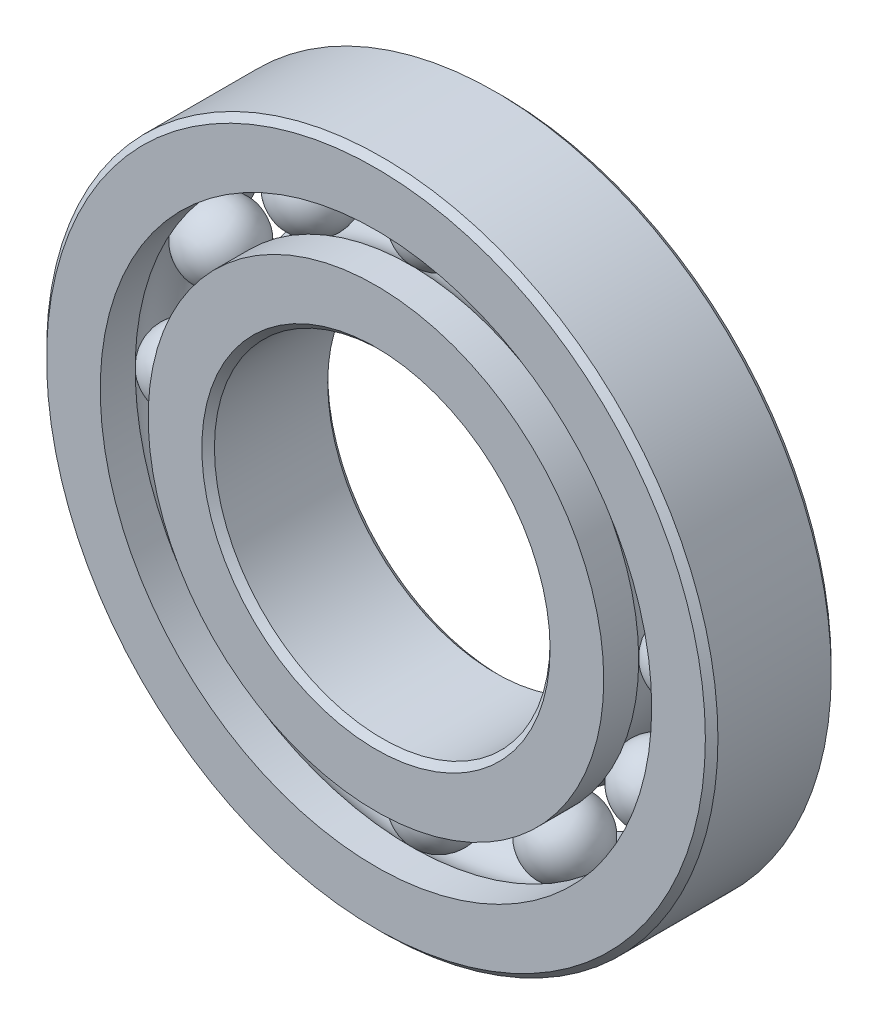
ISO-10303-21;
HEADER;
FILE_DESCRIPTION(('STEP AP214'),'2;1');
FILE_NAME('part.step','',(''),(''),'','','');
FILE_SCHEMA(('AUTOMOTIVE_DESIGN { 1 0 10303 214 1 1 1 1 }'));
ENDSEC;
DATA;
#1=APPLICATION_CONTEXT('core data for automotive mechanical design processes');
#2=APPLICATION_PROTOCOL_DEFINITION('international standard','automotive_design',2000,#1);
#3=PRODUCT_CONTEXT('',#1,'mechanical');
#4=PRODUCT('Part','Part','',(#3));
#5=PRODUCT_RELATED_PRODUCT_CATEGORY('part','',(#4));
#6=PRODUCT_DEFINITION_FORMATION('','',#4);
#7=PRODUCT_DEFINITION_CONTEXT('part definition',#1,'design');
#8=PRODUCT_DEFINITION('design','',#6,#7);
#9=PRODUCT_DEFINITION_SHAPE('','',#8);
#10=(LENGTH_UNIT() NAMED_UNIT(*) SI_UNIT(.MILLI.,.METRE.));
#11=(NAMED_UNIT(*) PLANE_ANGLE_UNIT() SI_UNIT($,.RADIAN.));
#12=(NAMED_UNIT(*) SI_UNIT($,.STERADIAN.) SOLID_ANGLE_UNIT());
#13=UNCERTAINTY_MEASURE_WITH_UNIT(LENGTH_MEASURE(1.E-05),#10,'distance_accuracy_value','');
#14=(GEOMETRIC_REPRESENTATION_CONTEXT(3) GLOBAL_UNCERTAINTY_ASSIGNED_CONTEXT((#13)) GLOBAL_UNIT_ASSIGNED_CONTEXT((#10,
#11,#12)) REPRESENTATION_CONTEXT('',''));
#15=CARTESIAN_POINT('',(0.,0.,0.));
#16=DIRECTION('',(0.,0.,1.));
#17=DIRECTION('',(1.,0.,0.));
#18=AXIS2_PLACEMENT_3D('',#15,#16,#17);
#19=CARTESIAN_POINT('',(-9.52499999999979,16.4977839420937,0.));
#20=DIRECTION('',(0.,0.,1.));
#21=DIRECTION('',(-0.499999999999989,0.866025403784445,0.));
#22=AXIS2_PLACEMENT_3D('',#19,#20,#21);
#23=SPHERICAL_SURFACE('',#22,2.78781463351475);
#24=CARTESIAN_POINT('',(-9.52499999999979,16.4977839420937,2.78781463351475));
#25=VERTEX_POINT('',#24);
#26=VERTEX_LOOP('',#25);
#27=FACE_BOUND('',#26,.T.);
#28=ADVANCED_FACE('F39',(#27),#23,.T.);
#29=CLOSED_SHELL('',(#28));
#30=MANIFOLD_SOLID_BREP('B2',#29);
#31=CARTESIAN_POINT('',(-16.4977839420934,9.52500000000019,0.));
#32=DIRECTION('',(0.,0.,1.));
#33=DIRECTION('',(-0.866025403784433,0.50000000000001,0.));
#34=AXIS2_PLACEMENT_3D('',#31,#32,#33);
#35=SPHERICAL_SURFACE('',#34,2.78781463351475);
#36=CARTESIAN_POINT('',(-16.4977839420934,9.52500000000019,2.78781463351475));
#37=VERTEX_POINT('',#36);
#38=VERTEX_LOOP('',#37);
#39=FACE_BOUND('',#38,.T.);
#40=ADVANCED_FACE('F59',(#39),#35,.T.);
#41=CLOSED_SHELL('',(#40));
#42=MANIFOLD_SOLID_BREP('B6',#41);
#43=CARTESIAN_POINT('',(-19.05,1.99538274087401E-13,0.));
#44=DIRECTION('',(0.,0.,1.));
#45=DIRECTION('',(-1.,0.,0.));
#46=AXIS2_PLACEMENT_3D('',#43,#44,#45);
#47=SPHERICAL_SURFACE('',#46,2.78781463351475);
#48=CARTESIAN_POINT('',(-19.05,1.99538274087401E-13,2.78781463351475));
#49=VERTEX_POINT('',#48);
#50=VERTEX_LOOP('',#49);
#51=FACE_BOUND('',#50,.T.);
#52=ADVANCED_FACE('F79',(#51),#47,.T.);
#53=CLOSED_SHELL('',(#52));
#54=MANIFOLD_SOLID_BREP('B35',#53);
#55=CARTESIAN_POINT('',(-16.4977839420936,-9.52499999999985,0.));
#56=DIRECTION('',(0.,0.,1.));
#57=DIRECTION('',(-0.866025403784443,-0.499999999999992,0.));
#58=AXIS2_PLACEMENT_3D('',#55,#56,#57);
#59=SPHERICAL_SURFACE('',#58,2.78781463351475);
#60=CARTESIAN_POINT('',(-16.4977839420936,-9.52499999999985,2.78781463351475));
#61=VERTEX_POINT('',#60);
#62=VERTEX_LOOP('',#61);
#63=FACE_BOUND('',#62,.T.);
#64=ADVANCED_FACE('F99',(#63),#59,.T.);
#65=CLOSED_SHELL('',(#64));
#66=MANIFOLD_SOLID_BREP('B55',#65);
#67=CARTESIAN_POINT('',(-9.52500000000014,-16.4977839420935,0.));
#68=DIRECTION('',(0.,0.,1.));
#69=DIRECTION('',(-0.500000000000007,-0.866025403784435,0.));
#70=AXIS2_PLACEMENT_3D('',#67,#68,#69);
#71=SPHERICAL_SURFACE('',#70,2.78781463351475);
#72=CARTESIAN_POINT('',(-9.52500000000014,-16.4977839420935,2.78781463351475));
#73=VERTEX_POINT('',#72);
#74=VERTEX_LOOP('',#73);
#75=FACE_BOUND('',#74,.T.);
#76=ADVANCED_FACE('F119',(#75),#71,.T.);
#77=CLOSED_SHELL('',(#76));
#78=MANIFOLD_SOLID_BREP('B75',#77);
#79=CARTESIAN_POINT('',(-1.33025516058267E-13,-19.05,0.));
#80=DIRECTION('',(0.,0.,1.));
#81=DIRECTION('',(0.,-1.,0.));
#82=AXIS2_PLACEMENT_3D('',#79,#80,#81);
#83=SPHERICAL_SURFACE('',#82,2.78781463351475);
#84=CARTESIAN_POINT('',(-1.33025516058267E-13,-19.05,2.78781463351475));
#85=VERTEX_POINT('',#84);
#86=VERTEX_LOOP('',#85);
#87=FACE_BOUND('',#86,.T.);
#88=ADVANCED_FACE('F139',(#87),#83,.T.);
#89=CLOSED_SHELL('',(#88));
#90=MANIFOLD_SOLID_BREP('B95',#89);
#91=CARTESIAN_POINT('',(9.5249999999999,-16.4977839420936,0.));
#92=DIRECTION('',(0.,0.,1.));
#93=DIRECTION('',(0.499999999999995,-0.866025403784442,0.));
#94=AXIS2_PLACEMENT_3D('',#91,#92,#93);
#95=SPHERICAL_SURFACE('',#94,2.78781463351475);
#96=CARTESIAN_POINT('',(9.5249999999999,-16.4977839420936,2.78781463351475));
#97=VERTEX_POINT('',#96);
#98=VERTEX_LOOP('',#97);
#99=FACE_BOUND('',#98,.T.);
#100=ADVANCED_FACE('F159',(#99),#95,.T.);
#101=CLOSED_SHELL('',(#100));
#102=MANIFOLD_SOLID_BREP('B115',#101);
#103=CARTESIAN_POINT('',(16.4977839420935,-9.52500000000008,0.));
#104=DIRECTION('',(0.,0.,1.));
#105=DIRECTION('',(0.866025403784436,-0.500000000000004,0.));
#106=AXIS2_PLACEMENT_3D('',#103,#104,#105);
#107=SPHERICAL_SURFACE('',#106,2.78781463351475);
#108=CARTESIAN_POINT('',(16.4977839420935,-9.52500000000008,2.78781463351475));
#109=VERTEX_POINT('',#108);
#110=VERTEX_LOOP('',#109);
#111=FACE_BOUND('',#110,.T.);
#112=ADVANCED_FACE('F179',(#111),#107,.T.);
#113=CLOSED_SHELL('',(#112));
#114=MANIFOLD_SOLID_BREP('B135',#113);
#115=CARTESIAN_POINT('',(19.05,0.,0.));
#116=DIRECTION('',(0.,0.,1.));
#117=DIRECTION('',(1.,0.,0.));
#118=AXIS2_PLACEMENT_3D('',#115,#116,#117);
#119=SPHERICAL_SURFACE('',#118,2.78781463351475);
#120=CARTESIAN_POINT('',(19.05,0.,2.78781463351475));
#121=VERTEX_POINT('',#120);
#122=VERTEX_LOOP('',#121);
#123=FACE_BOUND('',#122,.T.);
#124=ADVANCED_FACE('F199',(#123),#119,.T.);
#125=CLOSED_SHELL('',(#124));
#126=MANIFOLD_SOLID_BREP('B155',#125);
#127=CARTESIAN_POINT('',(16.4977839420936,9.52499999999996,0.));
#128=DIRECTION('',(0.,0.,1.));
#129=DIRECTION('',(0.86602540378444,0.499999999999998,0.));
#130=AXIS2_PLACEMENT_3D('',#127,#128,#129);
#131=SPHERICAL_SURFACE('',#130,2.78781463351475);
#132=CARTESIAN_POINT('',(16.4977839420936,9.52499999999996,2.78781463351475));
#133=VERTEX_POINT('',#132);
#134=VERTEX_LOOP('',#133);
#135=FACE_BOUND('',#134,.T.);
#136=ADVANCED_FACE('F219',(#135),#131,.T.);
#137=CLOSED_SHELL('',(#136));
#138=MANIFOLD_SOLID_BREP('B175',#137);
#139=CARTESIAN_POINT('',(9.52500000000002,16.4977839420935,0.));
#140=DIRECTION('',(0.,0.,1.));
#141=DIRECTION('',(0.500000000000001,0.866025403784438,0.));
#142=AXIS2_PLACEMENT_3D('',#139,#140,#141);
#143=SPHERICAL_SURFACE('',#142,2.78781463351475);
#144=CARTESIAN_POINT('',(9.52500000000002,16.4977839420935,2.78781463351475));
#145=VERTEX_POINT('',#144);
#146=VERTEX_LOOP('',#145);
#147=FACE_BOUND('',#146,.T.);
#148=ADVANCED_FACE('F239',(#147),#143,.T.);
#149=CLOSED_SHELL('',(#148));
#150=MANIFOLD_SOLID_BREP('B195',#149);
#151=CARTESIAN_POINT('',(0.,19.05,0.));
#152=DIRECTION('',(0.,0.,1.));
#153=DIRECTION('',(0.,1.,0.));
#154=AXIS2_PLACEMENT_3D('',#151,#152,#153);
#155=SPHERICAL_SURFACE('',#154,2.78781463351475);
#156=CARTESIAN_POINT('',(0.,19.05,2.78781463351475));
#157=VERTEX_POINT('',#156);
#158=VERTEX_LOOP('',#157);
#159=FACE_BOUND('',#158,.T.);
#160=ADVANCED_FACE('F261',(#159),#155,.T.);
#161=CLOSED_SHELL('',(#160));
#162=MANIFOLD_SOLID_BREP('B215',#161);
#163=CARTESIAN_POINT('',(0.,17.2357142857143,4.7625));
#164=DIRECTION('',(0.,0.,-1.));
#165=DIRECTION('',(-1.,0.,0.));
#166=AXIS2_PLACEMENT_3D('',#163,#164,#165);
#167=PLANE('',#166);
#168=CARTESIAN_POINT('',(0.,0.,4.7625));
#169=DIRECTION('',(0.,0.,1.));
#170=DIRECTION('',(1.,0.,0.));
#171=AXIS2_PLACEMENT_3D('',#168,#169,#170);
#172=CIRCLE('',#171,13.17625);
#173=CARTESIAN_POINT('',(13.17625,0.,4.7625));
#174=VERTEX_POINT('',#173);
#175=EDGE_CURVE('E308',#174,#174,#172,.T.);
#176=ORIENTED_EDGE('',*,*,#175,.F.);
#177=EDGE_LOOP('',(#176));
#178=FACE_BOUND('',#177,.T.);
#179=CARTESIAN_POINT('',(0.,0.,4.7625));
#180=DIRECTION('',(0.,0.,1.));
#181=DIRECTION('',(1.,0.,0.));
#182=AXIS2_PLACEMENT_3D('',#179,#180,#181);
#183=CIRCLE('',#182,17.2357142857143);
#184=CARTESIAN_POINT('',(17.2357142857143,0.,4.7625));
#185=VERTEX_POINT('',#184);
#186=EDGE_CURVE('E260',#185,#185,#183,.T.);
#187=ORIENTED_EDGE('',*,*,#186,.T.);
#188=EDGE_LOOP('',(#187));
#189=FACE_BOUND('',#188,.T.);
#190=ADVANCED_FACE('F280',(#178,#189),#167,.F.);
#191=CARTESIAN_POINT('',(0.,0.,4.7625));
#192=DIRECTION('',(0.,0.,1.));
#193=DIRECTION('',(1.,0.,0.));
#194=AXIS2_PLACEMENT_3D('',#191,#192,#193);
#195=CYLINDRICAL_SURFACE('',#194,17.2357142857143);
#196=ORIENTED_EDGE('',*,*,#186,.F.);
#197=EDGE_LOOP('',(#196));
#198=FACE_BOUND('',#197,.T.);
#199=CARTESIAN_POINT('',(0.,0.,2.11666666666667));
#200=DIRECTION('',(0.,0.,1.));
#201=DIRECTION('',(1.,0.,0.));
#202=AXIS2_PLACEMENT_3D('',#199,#200,#201);
#203=CIRCLE('',#202,17.2357142857143);
#204=CARTESIAN_POINT('',(17.2357142857143,0.,2.11666666666667));
#205=VERTEX_POINT('',#204);
#206=EDGE_CURVE('E286',#205,#205,#203,.T.);
#207=ORIENTED_EDGE('',*,*,#206,.T.);
#208=EDGE_LOOP('',(#207));
#209=FACE_BOUND('',#208,.T.);
#210=ADVANCED_FACE('F315',(#198,#209),#195,.T.);
#211=CARTESIAN_POINT('',(0.,0.,0.));
#212=DIRECTION('',(0.,0.,1.));
#213=DIRECTION('',(1.,0.,0.));
#214=AXIS2_PLACEMENT_3D('',#211,#212,#213);
#215=TOROIDAL_SURFACE('',#214,19.05,2.78781463351475);
#216=ORIENTED_EDGE('',*,*,#206,.F.);
#217=EDGE_LOOP('',(#216));
#218=FACE_BOUND('',#217,.T.);
#219=CARTESIAN_POINT('',(0.,0.,-2.11666666666667));
#220=DIRECTION('',(0.,0.,1.));
#221=DIRECTION('',(1.,0.,0.));
#222=AXIS2_PLACEMENT_3D('',#219,#220,#221);
#223=CIRCLE('',#222,17.2357142857143);
#224=CARTESIAN_POINT('',(17.2357142857143,0.,-2.11666666666667));
#225=VERTEX_POINT('',#224);
#226=EDGE_CURVE('E290',#225,#225,#223,.T.);
#227=ORIENTED_EDGE('',*,*,#226,.T.);
#228=EDGE_LOOP('',(#227));
#229=FACE_BOUND('',#228,.T.);
#230=ADVANCED_FACE('F319',(#218,#229),#215,.F.);
#231=CARTESIAN_POINT('',(0.,0.,4.7625));
#232=DIRECTION('',(0.,0.,1.));
#233=DIRECTION('',(1.,0.,0.));
#234=AXIS2_PLACEMENT_3D('',#231,#232,#233);
#235=CYLINDRICAL_SURFACE('',#234,17.2357142857143);
#236=ORIENTED_EDGE('',*,*,#226,.F.);
#237=EDGE_LOOP('',(#236));
#238=FACE_BOUND('',#237,.T.);
#239=CARTESIAN_POINT('',(0.,0.,-4.7625));
#240=DIRECTION('',(0.,0.,1.));
#241=DIRECTION('',(1.,0.,0.));
#242=AXIS2_PLACEMENT_3D('',#239,#240,#241);
#243=CIRCLE('',#242,17.2357142857143);
#244=CARTESIAN_POINT('',(17.2357142857143,0.,-4.7625));
#245=VERTEX_POINT('',#244);
#246=EDGE_CURVE('E294',#245,#245,#243,.T.);
#247=ORIENTED_EDGE('',*,*,#246,.T.);
#248=EDGE_LOOP('',(#247));
#249=FACE_BOUND('',#248,.T.);
#250=ADVANCED_FACE('F324',(#238,#249),#235,.T.);
#251=CARTESIAN_POINT('',(0.,13.17625,-4.7625));
#252=DIRECTION('',(0.,0.,1.));
#253=DIRECTION('',(1.,0.,0.));
#254=AXIS2_PLACEMENT_3D('',#251,#252,#253);
#255=PLANE('',#254);
#256=ORIENTED_EDGE('',*,*,#246,.F.);
#257=EDGE_LOOP('',(#256));
#258=FACE_BOUND('',#257,.T.);
#259=CARTESIAN_POINT('',(0.,0.,-4.7625));
#260=DIRECTION('',(0.,0.,1.));
#261=DIRECTION('',(1.,0.,0.));
#262=AXIS2_PLACEMENT_3D('',#259,#260,#261);
#263=CIRCLE('',#262,13.17625);
#264=CARTESIAN_POINT('',(13.17625,0.,-4.7625));
#265=VERTEX_POINT('',#264);
#266=EDGE_CURVE('E299',#265,#265,#263,.T.);
#267=ORIENTED_EDGE('',*,*,#266,.T.);
#268=EDGE_LOOP('',(#267));
#269=FACE_BOUND('',#268,.T.);
#270=ADVANCED_FACE('F330',(#258,#269),#255,.F.);
#271=CARTESIAN_POINT('',(0.,0.,-4.28625));
#272=DIRECTION('',(0.,0.,-1.));
#273=DIRECTION('',(-1.,0.,0.));
#274=AXIS2_PLACEMENT_3D('',#271,#272,#273);
#275=CONICAL_SURFACE('',#274,12.7,0.785398163397445);
#276=ORIENTED_EDGE('',*,*,#266,.F.);
#277=EDGE_LOOP('',(#276));
#278=FACE_BOUND('',#277,.T.);
#279=CARTESIAN_POINT('',(0.,0.,-4.28625));
#280=DIRECTION('',(0.,0.,1.));
#281=DIRECTION('',(1.,0.,0.));
#282=AXIS2_PLACEMENT_3D('',#279,#280,#281);
#283=CIRCLE('',#282,12.7);
#284=CARTESIAN_POINT('',(12.7,0.,-4.28625));
#285=VERTEX_POINT('',#284);
#286=EDGE_CURVE('E302',#285,#285,#283,.T.);
#287=ORIENTED_EDGE('',*,*,#286,.T.);
#288=EDGE_LOOP('',(#287));
#289=FACE_BOUND('',#288,.T.);
#290=ADVANCED_FACE('F334',(#278,#289),#275,.F.);
#291=CARTESIAN_POINT('',(0.,0.,4.7625));
#292=DIRECTION('',(0.,0.,1.));
#293=DIRECTION('',(1.,0.,0.));
#294=AXIS2_PLACEMENT_3D('',#291,#292,#293);
#295=CYLINDRICAL_SURFACE('',#294,12.7);
#296=ORIENTED_EDGE('',*,*,#286,.F.);
#297=EDGE_LOOP('',(#296));
#298=FACE_BOUND('',#297,.T.);
#299=CARTESIAN_POINT('',(0.,0.,4.28625));
#300=DIRECTION('',(0.,0.,1.));
#301=DIRECTION('',(1.,0.,0.));
#302=AXIS2_PLACEMENT_3D('',#299,#300,#301);
#303=CIRCLE('',#302,12.7);
#304=CARTESIAN_POINT('',(12.7,0.,4.28625));
#305=VERTEX_POINT('',#304);
#306=EDGE_CURVE('E305',#305,#305,#303,.T.);
#307=ORIENTED_EDGE('',*,*,#306,.T.);
#308=EDGE_LOOP('',(#307));
#309=FACE_BOUND('',#308,.T.);
#310=ADVANCED_FACE('F338',(#298,#309),#295,.F.);
#311=CARTESIAN_POINT('',(0.,0.,4.7625));
#312=DIRECTION('',(0.,0.,1.));
#313=DIRECTION('',(1.,0.,0.));
#314=AXIS2_PLACEMENT_3D('',#311,#312,#313);
#315=CONICAL_SURFACE('',#314,13.17625,0.785398163397453);
#316=ORIENTED_EDGE('',*,*,#306,.F.);
#317=EDGE_LOOP('',(#316));
#318=FACE_BOUND('',#317,.T.);
#319=ORIENTED_EDGE('',*,*,#175,.T.);
#320=EDGE_LOOP('',(#319));
#321=FACE_BOUND('',#320,.T.);
#322=ADVANCED_FACE('F312',(#318,#321),#315,.F.);
#323=CLOSED_SHELL('',(#190,#210,#230,#250,#270,#290,#310,#322));
#324=MANIFOLD_SOLID_BREP('B235',#323);
#325=CARTESIAN_POINT('',(0.,0.,4.28625));
#326=DIRECTION('',(0.,0.,-1.));
#327=DIRECTION('',(-1.,0.,0.));
#328=AXIS2_PLACEMENT_3D('',#325,#326,#327);
#329=CONICAL_SURFACE('',#328,25.4,0.785398163397446);
#330=CARTESIAN_POINT('',(0.,0.,4.7625));
#331=DIRECTION('',(0.,0.,1.));
#332=DIRECTION('',(1.,0.,0.));
#333=AXIS2_PLACEMENT_3D('',#330,#331,#332);
#334=CIRCLE('',#333,24.92375);
#335=CARTESIAN_POINT('',(24.92375,0.,4.7625));
#336=VERTEX_POINT('',#335);
#337=EDGE_CURVE('E429',#336,#336,#334,.T.);
#338=ORIENTED_EDGE('',*,*,#337,.F.);
#339=EDGE_LOOP('',(#338));
#340=FACE_BOUND('',#339,.T.);
#341=CARTESIAN_POINT('',(0.,0.,4.28625));
#342=DIRECTION('',(0.,0.,1.));
#343=DIRECTION('',(1.,0.,0.));
#344=AXIS2_PLACEMENT_3D('',#341,#342,#343);
#345=CIRCLE('',#344,25.4);
#346=CARTESIAN_POINT('',(25.4,0.,4.28625));
#347=VERTEX_POINT('',#346);
#348=EDGE_CURVE('E279',#347,#347,#345,.T.);
#349=ORIENTED_EDGE('',*,*,#348,.T.);
#350=EDGE_LOOP('',(#349));
#351=FACE_BOUND('',#350,.T.);
#352=ADVANCED_FACE('F401',(#340,#351),#329,.T.);
#353=CARTESIAN_POINT('',(0.,0.,4.7625));
#354=DIRECTION('',(0.,0.,1.));
#355=DIRECTION('',(1.,0.,0.));
#356=AXIS2_PLACEMENT_3D('',#353,#354,#355);
#357=CYLINDRICAL_SURFACE('',#356,25.4);
#358=ORIENTED_EDGE('',*,*,#348,.F.);
#359=EDGE_LOOP('',(#358));
#360=FACE_BOUND('',#359,.T.);
#361=CARTESIAN_POINT('',(0.,0.,-4.28625));
#362=DIRECTION('',(0.,0.,1.));
#363=DIRECTION('',(1.,0.,0.));
#364=AXIS2_PLACEMENT_3D('',#361,#362,#363);
#365=CIRCLE('',#364,25.4);
#366=CARTESIAN_POINT('',(25.4,0.,-4.28625));
#367=VERTEX_POINT('',#366);
#368=EDGE_CURVE('E407',#367,#367,#365,.T.);
#369=ORIENTED_EDGE('',*,*,#368,.T.);
#370=EDGE_LOOP('',(#369));
#371=FACE_BOUND('',#370,.T.);
#372=ADVANCED_FACE('F436',(#360,#371),#357,.T.);
#373=CARTESIAN_POINT('',(0.,0.,-4.7625));
#374=DIRECTION('',(0.,0.,1.));
#375=DIRECTION('',(1.,0.,0.));
#376=AXIS2_PLACEMENT_3D('',#373,#374,#375);
#377=CONICAL_SURFACE('',#376,24.92375,0.785398163397445);
#378=ORIENTED_EDGE('',*,*,#368,.F.);
#379=EDGE_LOOP('',(#378));
#380=FACE_BOUND('',#379,.T.);
#381=CARTESIAN_POINT('',(0.,0.,-4.7625));
#382=DIRECTION('',(0.,0.,1.));
#383=DIRECTION('',(1.,0.,0.));
#384=AXIS2_PLACEMENT_3D('',#381,#382,#383);
#385=CIRCLE('',#384,24.92375);
#386=CARTESIAN_POINT('',(24.92375,0.,-4.7625));
#387=VERTEX_POINT('',#386);
#388=EDGE_CURVE('E411',#387,#387,#385,.T.);
#389=ORIENTED_EDGE('',*,*,#388,.T.);
#390=EDGE_LOOP('',(#389));
#391=FACE_BOUND('',#390,.T.);
#392=ADVANCED_FACE('F440',(#380,#391),#377,.T.);
#393=CARTESIAN_POINT('',(0.,24.92375,-4.7625));
#394=DIRECTION('',(0.,0.,1.));
#395=DIRECTION('',(1.,0.,0.));
#396=AXIS2_PLACEMENT_3D('',#393,#394,#395);
#397=PLANE('',#396);
#398=ORIENTED_EDGE('',*,*,#388,.F.);
#399=EDGE_LOOP('',(#398));
#400=FACE_BOUND('',#399,.T.);
#401=CARTESIAN_POINT('',(0.,0.,-4.7625));
#402=DIRECTION('',(0.,0.,1.));
#403=DIRECTION('',(1.,0.,0.));
#404=AXIS2_PLACEMENT_3D('',#401,#402,#403);
#405=CIRCLE('',#404,20.8642857142857);
#406=CARTESIAN_POINT('',(20.8642857142857,0.,-4.7625));
#407=VERTEX_POINT('',#406);
#408=EDGE_CURVE('E415',#407,#407,#405,.T.);
#409=ORIENTED_EDGE('',*,*,#408,.T.);
#410=EDGE_LOOP('',(#409));
#411=FACE_BOUND('',#410,.T.);
#412=ADVANCED_FACE('F445',(#400,#411),#397,.F.);
#413=CARTESIAN_POINT('',(0.,0.,4.7625));
#414=DIRECTION('',(0.,0.,1.));
#415=DIRECTION('',(1.,0.,0.));
#416=AXIS2_PLACEMENT_3D('',#413,#414,#415);
#417=CYLINDRICAL_SURFACE('',#416,20.8642857142857);
#418=ORIENTED_EDGE('',*,*,#408,.F.);
#419=EDGE_LOOP('',(#418));
#420=FACE_BOUND('',#419,.T.);
#421=CARTESIAN_POINT('',(0.,0.,-2.11666666666666));
#422=DIRECTION('',(0.,0.,1.));
#423=DIRECTION('',(1.,0.,0.));
#424=AXIS2_PLACEMENT_3D('',#421,#422,#423);
#425=CIRCLE('',#424,20.8642857142857);
#426=CARTESIAN_POINT('',(20.8642857142857,0.,-2.11666666666666));
#427=VERTEX_POINT('',#426);
#428=EDGE_CURVE('E420',#427,#427,#425,.T.);
#429=ORIENTED_EDGE('',*,*,#428,.T.);
#430=EDGE_LOOP('',(#429));
#431=FACE_BOUND('',#430,.T.);
#432=ADVANCED_FACE('F451',(#420,#431),#417,.F.);
#433=CARTESIAN_POINT('',(0.,0.,0.));
#434=DIRECTION('',(0.,0.,1.));
#435=DIRECTION('',(1.,0.,0.));
#436=AXIS2_PLACEMENT_3D('',#433,#434,#435);
#437=TOROIDAL_SURFACE('',#436,19.05,2.78781463351475);
#438=ORIENTED_EDGE('',*,*,#428,.F.);
#439=EDGE_LOOP('',(#438));
#440=FACE_BOUND('',#439,.T.);
#441=CARTESIAN_POINT('',(0.,0.,2.11666666666667));
#442=DIRECTION('',(0.,0.,1.));
#443=DIRECTION('',(1.,0.,0.));
#444=AXIS2_PLACEMENT_3D('',#441,#442,#443);
#445=CIRCLE('',#444,20.8642857142857);
#446=CARTESIAN_POINT('',(20.8642857142857,0.,2.11666666666667));
#447=VERTEX_POINT('',#446);
#448=EDGE_CURVE('E423',#447,#447,#445,.T.);
#449=ORIENTED_EDGE('',*,*,#448,.T.);
#450=EDGE_LOOP('',(#449));
#451=FACE_BOUND('',#450,.T.);
#452=ADVANCED_FACE('F455',(#440,#451),#437,.F.);
#453=CARTESIAN_POINT('',(0.,0.,4.7625));
#454=DIRECTION('',(0.,0.,1.));
#455=DIRECTION('',(1.,0.,0.));
#456=AXIS2_PLACEMENT_3D('',#453,#454,#455);
#457=CYLINDRICAL_SURFACE('',#456,20.8642857142857);
#458=ORIENTED_EDGE('',*,*,#448,.F.);
#459=EDGE_LOOP('',(#458));
#460=FACE_BOUND('',#459,.T.);
#461=CARTESIAN_POINT('',(0.,0.,4.7625));
#462=DIRECTION('',(0.,0.,1.));
#463=DIRECTION('',(1.,0.,0.));
#464=AXIS2_PLACEMENT_3D('',#461,#462,#463);
#465=CIRCLE('',#464,20.8642857142857);
#466=CARTESIAN_POINT('',(20.8642857142857,0.,4.7625));
#467=VERTEX_POINT('',#466);
#468=EDGE_CURVE('E426',#467,#467,#465,.T.);
#469=ORIENTED_EDGE('',*,*,#468,.T.);
#470=EDGE_LOOP('',(#469));
#471=FACE_BOUND('',#470,.T.);
#472=ADVANCED_FACE('F459',(#460,#471),#457,.F.);
#473=CARTESIAN_POINT('',(0.,24.92375,4.7625));
#474=DIRECTION('',(0.,0.,-1.));
#475=DIRECTION('',(-1.,0.,0.));
#476=AXIS2_PLACEMENT_3D('',#473,#474,#475);
#477=PLANE('',#476);
#478=ORIENTED_EDGE('',*,*,#468,.F.);
#479=EDGE_LOOP('',(#478));
#480=FACE_BOUND('',#479,.T.);
#481=ORIENTED_EDGE('',*,*,#337,.T.);
#482=EDGE_LOOP('',(#481));
#483=FACE_BOUND('',#482,.T.);
#484=ADVANCED_FACE('F433',(#480,#483),#477,.F.);
#485=CLOSED_SHELL('',(#352,#372,#392,#412,#432,#452,#472,#484));
#486=MANIFOLD_SOLID_BREP('B255',#485);
#487=ADVANCED_BREP_SHAPE_REPRESENTATION('',(#18,#30,#42,#54,#66,#78,#90,#102,#114,#126,#138,
#150,#162,#324,#486),#14);
#488=SHAPE_DEFINITION_REPRESENTATION(#9,#487);
ENDSEC;
END-ISO-10303-21;
